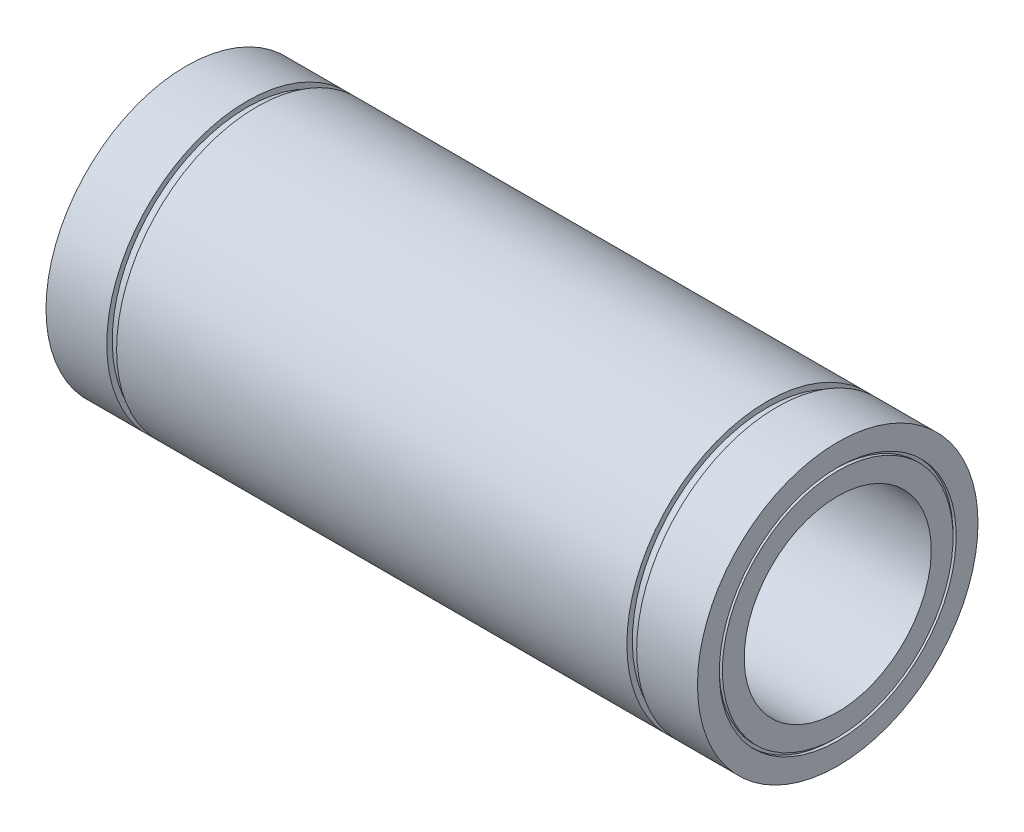
ISO-10303-21;
HEADER;
FILE_DESCRIPTION(('STEP AP214'),'2;1');
FILE_NAME('part.step','',(''),(''),'','','');
FILE_SCHEMA(('AUTOMOTIVE_DESIGN { 1 0 10303 214 1 1 1 1 }'));
ENDSEC;
DATA;
#1=APPLICATION_CONTEXT('core data for automotive mechanical design processes');
#2=APPLICATION_PROTOCOL_DEFINITION('international standard','automotive_design',2000,#1);
#3=PRODUCT_CONTEXT('',#1,'mechanical');
#4=PRODUCT('Part','Part','',(#3));
#5=PRODUCT_RELATED_PRODUCT_CATEGORY('part','',(#4));
#6=PRODUCT_DEFINITION_FORMATION('','',#4);
#7=PRODUCT_DEFINITION_CONTEXT('part definition',#1,'design');
#8=PRODUCT_DEFINITION('design','',#6,#7);
#9=PRODUCT_DEFINITION_SHAPE('','',#8);
#10=(LENGTH_UNIT() NAMED_UNIT(*) SI_UNIT(.MILLI.,.METRE.));
#11=(NAMED_UNIT(*) PLANE_ANGLE_UNIT() SI_UNIT($,.RADIAN.));
#12=(NAMED_UNIT(*) SI_UNIT($,.STERADIAN.) SOLID_ANGLE_UNIT());
#13=UNCERTAINTY_MEASURE_WITH_UNIT(LENGTH_MEASURE(1.E-05),#10,'distance_accuracy_value','');
#14=(GEOMETRIC_REPRESENTATION_CONTEXT(3) GLOBAL_UNCERTAINTY_ASSIGNED_CONTEXT((#13)) GLOBAL_UNIT_ASSIGNED_CONTEXT((#10,
#11,#12)) REPRESENTATION_CONTEXT('',''));
#15=CARTESIAN_POINT('',(0.,0.,0.));
#16=DIRECTION('',(0.,0.,1.));
#17=DIRECTION('',(1.,0.,0.));
#18=AXIS2_PLACEMENT_3D('',#15,#16,#17);
#19=CARTESIAN_POINT('',(-104.5,38.,0.));
#20=DIRECTION('',(-1.,0.,0.));
#21=DIRECTION('',(0.,-1.,0.));
#22=AXIS2_PLACEMENT_3D('',#19,#20,#21);
#23=PLANE('',#22);
#24=CARTESIAN_POINT('',(-104.5,0.,0.));
#25=DIRECTION('',(1.,0.,0.));
#26=DIRECTION('',(0.,1.,0.));
#27=AXIS2_PLACEMENT_3D('',#24,#25,#26);
#28=CIRCLE('',#27,38.);
#29=CARTESIAN_POINT('',(-104.5,38.,0.));
#30=VERTEX_POINT('',#29);
#31=EDGE_CURVE('E123',#30,#30,#28,.T.);
#32=ORIENTED_EDGE('',*,*,#31,.T.);
#33=EDGE_LOOP('',(#32));
#34=FACE_BOUND('',#33,.T.);
#35=CARTESIAN_POINT('',(-104.5,0.,0.));
#36=DIRECTION('',(1.,0.,0.));
#37=DIRECTION('',(0.,1.,0.));
#38=AXIS2_PLACEMENT_3D('',#35,#36,#37);
#39=CIRCLE('',#38,45.);
#40=CARTESIAN_POINT('',(-104.5,45.,0.));
#41=VERTEX_POINT('',#40);
#42=EDGE_CURVE('E10',#41,#41,#39,.T.);
#43=ORIENTED_EDGE('',*,*,#42,.F.);
#44=EDGE_LOOP('',(#43));
#45=FACE_BOUND('',#44,.T.);
#46=ADVANCED_FACE('F40',(#34,#45),#23,.T.);
#47=CARTESIAN_POINT('',(0.,0.,0.));
#48=DIRECTION('',(1.,0.,0.));
#49=DIRECTION('',(0.,1.,0.));
#50=AXIS2_PLACEMENT_3D('',#47,#48,#49);
#51=CYLINDRICAL_SURFACE('',#50,45.);
#52=ORIENTED_EDGE('',*,*,#42,.T.);
#53=EDGE_LOOP('',(#52));
#54=FACE_BOUND('',#53,.T.);
#55=CARTESIAN_POINT('',(-85.,0.,0.));
#56=DIRECTION('',(1.,0.,0.));
#57=DIRECTION('',(0.,1.,0.));
#58=AXIS2_PLACEMENT_3D('',#55,#56,#57);
#59=CIRCLE('',#58,45.);
#60=CARTESIAN_POINT('',(-85.,45.,0.));
#61=VERTEX_POINT('',#60);
#62=EDGE_CURVE('E47',#61,#61,#59,.T.);
#63=ORIENTED_EDGE('',*,*,#62,.F.);
#64=EDGE_LOOP('',(#63));
#65=FACE_BOUND('',#64,.T.);
#66=ADVANCED_FACE('F142',(#54,#65),#51,.T.);
#67=CARTESIAN_POINT('',(-85.,45.,0.));
#68=DIRECTION('',(1.,0.,0.));
#69=DIRECTION('',(0.,1.,0.));
#70=AXIS2_PLACEMENT_3D('',#67,#68,#69);
#71=PLANE('',#70);
#72=ORIENTED_EDGE('',*,*,#62,.T.);
#73=EDGE_LOOP('',(#72));
#74=FACE_BOUND('',#73,.T.);
#75=CARTESIAN_POINT('',(-85.,0.,0.));
#76=DIRECTION('',(1.,0.,0.));
#77=DIRECTION('',(0.,1.,0.));
#78=AXIS2_PLACEMENT_3D('',#75,#76,#77);
#79=CIRCLE('',#78,43.25);
#80=CARTESIAN_POINT('',(-85.,43.25,0.));
#81=VERTEX_POINT('',#80);
#82=EDGE_CURVE('E54',#81,#81,#79,.T.);
#83=ORIENTED_EDGE('',*,*,#82,.F.);
#84=EDGE_LOOP('',(#83));
#85=FACE_BOUND('',#84,.T.);
#86=ADVANCED_FACE('F146',(#74,#85),#71,.T.);
#87=CARTESIAN_POINT('',(0.,0.,0.));
#88=DIRECTION('',(1.,0.,0.));
#89=DIRECTION('',(0.,1.,0.));
#90=AXIS2_PLACEMENT_3D('',#87,#88,#89);
#91=CYLINDRICAL_SURFACE('',#90,43.25);
#92=ORIENTED_EDGE('',*,*,#82,.T.);
#93=EDGE_LOOP('',(#92));
#94=FACE_BOUND('',#93,.T.);
#95=CARTESIAN_POINT('',(-81.85,0.,0.));
#96=DIRECTION('',(1.,0.,0.));
#97=DIRECTION('',(0.,1.,0.));
#98=AXIS2_PLACEMENT_3D('',#95,#96,#97);
#99=CIRCLE('',#98,43.25);
#100=CARTESIAN_POINT('',(-81.85,43.25,0.));
#101=VERTEX_POINT('',#100);
#102=EDGE_CURVE('E61',#101,#101,#99,.T.);
#103=ORIENTED_EDGE('',*,*,#102,.F.);
#104=EDGE_LOOP('',(#103));
#105=FACE_BOUND('',#104,.T.);
#106=ADVANCED_FACE('F150',(#94,#105),#91,.T.);
#107=CARTESIAN_POINT('',(-81.85,43.25,0.));
#108=DIRECTION('',(-1.,0.,0.));
#109=DIRECTION('',(0.,-1.,0.));
#110=AXIS2_PLACEMENT_3D('',#107,#108,#109);
#111=PLANE('',#110);
#112=ORIENTED_EDGE('',*,*,#102,.T.);
#113=EDGE_LOOP('',(#112));
#114=FACE_BOUND('',#113,.T.);
#115=CARTESIAN_POINT('',(-81.85,0.,0.));
#116=DIRECTION('',(1.,0.,0.));
#117=DIRECTION('',(0.,1.,0.));
#118=AXIS2_PLACEMENT_3D('',#115,#116,#117);
#119=CIRCLE('',#118,45.);
#120=CARTESIAN_POINT('',(-81.85,45.,0.));
#121=VERTEX_POINT('',#120);
#122=EDGE_CURVE('E67',#121,#121,#119,.T.);
#123=ORIENTED_EDGE('',*,*,#122,.F.);
#124=EDGE_LOOP('',(#123));
#125=FACE_BOUND('',#124,.T.);
#126=ADVANCED_FACE('F156',(#114,#125),#111,.T.);
#127=CARTESIAN_POINT('',(0.,0.,0.));
#128=DIRECTION('',(1.,0.,0.));
#129=DIRECTION('',(0.,1.,0.));
#130=AXIS2_PLACEMENT_3D('',#127,#128,#129);
#131=CYLINDRICAL_SURFACE('',#130,45.);
#132=ORIENTED_EDGE('',*,*,#122,.T.);
#133=EDGE_LOOP('',(#132));
#134=FACE_BOUND('',#133,.T.);
#135=CARTESIAN_POINT('',(81.85,0.,0.));
#136=DIRECTION('',(1.,0.,0.));
#137=DIRECTION('',(0.,1.,0.));
#138=AXIS2_PLACEMENT_3D('',#135,#136,#137);
#139=CIRCLE('',#138,45.);
#140=CARTESIAN_POINT('',(81.85,45.,0.));
#141=VERTEX_POINT('',#140);
#142=EDGE_CURVE('E71',#141,#141,#139,.T.);
#143=ORIENTED_EDGE('',*,*,#142,.F.);
#144=EDGE_LOOP('',(#143));
#145=FACE_BOUND('',#144,.T.);
#146=ADVANCED_FACE('F160',(#134,#145),#131,.T.);
#147=CARTESIAN_POINT('',(81.85,45.,0.));
#148=DIRECTION('',(1.,0.,0.));
#149=DIRECTION('',(0.,1.,0.));
#150=AXIS2_PLACEMENT_3D('',#147,#148,#149);
#151=PLANE('',#150);
#152=ORIENTED_EDGE('',*,*,#142,.T.);
#153=EDGE_LOOP('',(#152));
#154=FACE_BOUND('',#153,.T.);
#155=CARTESIAN_POINT('',(81.85,0.,0.));
#156=DIRECTION('',(1.,0.,0.));
#157=DIRECTION('',(0.,1.,0.));
#158=AXIS2_PLACEMENT_3D('',#155,#156,#157);
#159=CIRCLE('',#158,43.25);
#160=CARTESIAN_POINT('',(81.85,43.25,0.));
#161=VERTEX_POINT('',#160);
#162=EDGE_CURVE('E75',#161,#161,#159,.T.);
#163=ORIENTED_EDGE('',*,*,#162,.F.);
#164=EDGE_LOOP('',(#163));
#165=FACE_BOUND('',#164,.T.);
#166=ADVANCED_FACE('F164',(#154,#165),#151,.T.);
#167=CARTESIAN_POINT('',(0.,0.,0.));
#168=DIRECTION('',(1.,0.,0.));
#169=DIRECTION('',(0.,1.,0.));
#170=AXIS2_PLACEMENT_3D('',#167,#168,#169);
#171=CYLINDRICAL_SURFACE('',#170,43.25);
#172=ORIENTED_EDGE('',*,*,#162,.T.);
#173=EDGE_LOOP('',(#172));
#174=FACE_BOUND('',#173,.T.);
#175=CARTESIAN_POINT('',(85.,0.,0.));
#176=DIRECTION('',(1.,0.,0.));
#177=DIRECTION('',(0.,1.,0.));
#178=AXIS2_PLACEMENT_3D('',#175,#176,#177);
#179=CIRCLE('',#178,43.25);
#180=CARTESIAN_POINT('',(85.,43.25,0.));
#181=VERTEX_POINT('',#180);
#182=EDGE_CURVE('E78',#181,#181,#179,.T.);
#183=ORIENTED_EDGE('',*,*,#182,.F.);
#184=EDGE_LOOP('',(#183));
#185=FACE_BOUND('',#184,.T.);
#186=ADVANCED_FACE('F168',(#174,#185),#171,.T.);
#187=CARTESIAN_POINT('',(85.,43.25,0.));
#188=DIRECTION('',(-1.,0.,0.));
#189=DIRECTION('',(0.,-1.,0.));
#190=AXIS2_PLACEMENT_3D('',#187,#188,#189);
#191=PLANE('',#190);
#192=ORIENTED_EDGE('',*,*,#182,.T.);
#193=EDGE_LOOP('',(#192));
#194=FACE_BOUND('',#193,.T.);
#195=CARTESIAN_POINT('',(85.,0.,0.));
#196=DIRECTION('',(1.,0.,0.));
#197=DIRECTION('',(0.,1.,0.));
#198=AXIS2_PLACEMENT_3D('',#195,#196,#197);
#199=CIRCLE('',#198,45.);
#200=CARTESIAN_POINT('',(85.,45.,0.));
#201=VERTEX_POINT('',#200);
#202=EDGE_CURVE('E81',#201,#201,#199,.T.);
#203=ORIENTED_EDGE('',*,*,#202,.F.);
#204=EDGE_LOOP('',(#203));
#205=FACE_BOUND('',#204,.T.);
#206=ADVANCED_FACE('F172',(#194,#205),#191,.T.);
#207=CARTESIAN_POINT('',(0.,0.,0.));
#208=DIRECTION('',(1.,0.,0.));
#209=DIRECTION('',(0.,1.,0.));
#210=AXIS2_PLACEMENT_3D('',#207,#208,#209);
#211=CYLINDRICAL_SURFACE('',#210,44.9999999999999);
#212=ORIENTED_EDGE('',*,*,#202,.T.);
#213=EDGE_LOOP('',(#212));
#214=FACE_BOUND('',#213,.T.);
#215=CARTESIAN_POINT('',(104.5,0.,0.));
#216=DIRECTION('',(1.,0.,0.));
#217=DIRECTION('',(0.,1.,0.));
#218=AXIS2_PLACEMENT_3D('',#215,#216,#217);
#219=CIRCLE('',#218,44.9999999999999);
#220=CARTESIAN_POINT('',(104.5,44.9999999999999,0.));
#221=VERTEX_POINT('',#220);
#222=EDGE_CURVE('E84',#221,#221,#219,.T.);
#223=ORIENTED_EDGE('',*,*,#222,.F.);
#224=EDGE_LOOP('',(#223));
#225=FACE_BOUND('',#224,.T.);
#226=ADVANCED_FACE('F176',(#214,#225),#211,.T.);
#227=CARTESIAN_POINT('',(104.5,44.9999999999999,0.));
#228=DIRECTION('',(1.,0.,0.));
#229=DIRECTION('',(0.,1.,0.));
#230=AXIS2_PLACEMENT_3D('',#227,#228,#229);
#231=PLANE('',#230);
#232=ORIENTED_EDGE('',*,*,#222,.T.);
#233=EDGE_LOOP('',(#232));
#234=FACE_BOUND('',#233,.T.);
#235=CARTESIAN_POINT('',(104.5,0.,0.));
#236=DIRECTION('',(1.,0.,0.));
#237=DIRECTION('',(0.,1.,0.));
#238=AXIS2_PLACEMENT_3D('',#235,#236,#237);
#239=CIRCLE('',#238,37.9999999999999);
#240=CARTESIAN_POINT('',(104.5,37.9999999999999,0.));
#241=VERTEX_POINT('',#240);
#242=EDGE_CURVE('E87',#241,#241,#239,.T.);
#243=ORIENTED_EDGE('',*,*,#242,.F.);
#244=EDGE_LOOP('',(#243));
#245=FACE_BOUND('',#244,.T.);
#246=ADVANCED_FACE('F180',(#234,#245),#231,.T.);
#247=CARTESIAN_POINT('',(0.,0.,0.));
#248=DIRECTION('',(1.,0.,0.));
#249=DIRECTION('',(0.,1.,0.));
#250=AXIS2_PLACEMENT_3D('',#247,#248,#249);
#251=CYLINDRICAL_SURFACE('',#250,37.9999999999999);
#252=ORIENTED_EDGE('',*,*,#242,.T.);
#253=EDGE_LOOP('',(#252));
#254=FACE_BOUND('',#253,.T.);
#255=CARTESIAN_POINT('',(103.5,0.,0.));
#256=DIRECTION('',(1.,0.,0.));
#257=DIRECTION('',(0.,1.,0.));
#258=AXIS2_PLACEMENT_3D('',#255,#256,#257);
#259=CIRCLE('',#258,37.9999999999999);
#260=CARTESIAN_POINT('',(103.5,37.9999999999999,0.));
#261=VERTEX_POINT('',#260);
#262=EDGE_CURVE('E91',#261,#261,#259,.T.);
#263=ORIENTED_EDGE('',*,*,#262,.F.);
#264=EDGE_LOOP('',(#263));
#265=FACE_BOUND('',#264,.T.);
#266=ADVANCED_FACE('F184',(#254,#265),#251,.F.);
#267=CARTESIAN_POINT('',(103.5,37.9999999999999,0.));
#268=DIRECTION('',(1.,0.,0.));
#269=DIRECTION('',(0.,1.,0.));
#270=AXIS2_PLACEMENT_3D('',#267,#268,#269);
#271=PLANE('',#270);
#272=ORIENTED_EDGE('',*,*,#262,.T.);
#273=EDGE_LOOP('',(#272));
#274=FACE_BOUND('',#273,.T.);
#275=CARTESIAN_POINT('',(103.5,0.,0.));
#276=DIRECTION('',(1.,0.,0.));
#277=DIRECTION('',(0.,1.,0.));
#278=AXIS2_PLACEMENT_3D('',#275,#276,#277);
#279=CIRCLE('',#278,36.9999999999999);
#280=CARTESIAN_POINT('',(103.5,36.9999999999999,0.));
#281=VERTEX_POINT('',#280);
#282=EDGE_CURVE('E95',#281,#281,#279,.T.);
#283=ORIENTED_EDGE('',*,*,#282,.F.);
#284=EDGE_LOOP('',(#283));
#285=FACE_BOUND('',#284,.T.);
#286=ADVANCED_FACE('F188',(#274,#285),#271,.T.);
#287=CARTESIAN_POINT('',(0.,0.,0.));
#288=DIRECTION('',(1.,0.,0.));
#289=DIRECTION('',(0.,1.,0.));
#290=AXIS2_PLACEMENT_3D('',#287,#288,#289);
#291=CYLINDRICAL_SURFACE('',#290,36.9999999999999);
#292=ORIENTED_EDGE('',*,*,#282,.T.);
#293=EDGE_LOOP('',(#292));
#294=FACE_BOUND('',#293,.T.);
#295=CARTESIAN_POINT('',(104.5,0.,0.));
#296=DIRECTION('',(1.,0.,0.));
#297=DIRECTION('',(0.,1.,0.));
#298=AXIS2_PLACEMENT_3D('',#295,#296,#297);
#299=CIRCLE('',#298,36.9999999999999);
#300=CARTESIAN_POINT('',(104.5,36.9999999999999,0.));
#301=VERTEX_POINT('',#300);
#302=EDGE_CURVE('E99',#301,#301,#299,.T.);
#303=ORIENTED_EDGE('',*,*,#302,.F.);
#304=EDGE_LOOP('',(#303));
#305=FACE_BOUND('',#304,.T.);
#306=ADVANCED_FACE('F192',(#294,#305),#291,.T.);
#307=CARTESIAN_POINT('',(104.5,36.9999999999999,0.));
#308=DIRECTION('',(1.,0.,0.));
#309=DIRECTION('',(0.,1.,0.));
#310=AXIS2_PLACEMENT_3D('',#307,#308,#309);
#311=PLANE('',#310);
#312=ORIENTED_EDGE('',*,*,#302,.T.);
#313=EDGE_LOOP('',(#312));
#314=FACE_BOUND('',#313,.T.);
#315=CARTESIAN_POINT('',(104.5,0.,0.));
#316=DIRECTION('',(1.,0.,0.));
#317=DIRECTION('',(0.,1.,0.));
#318=AXIS2_PLACEMENT_3D('',#315,#316,#317);
#319=CIRCLE('',#318,30.);
#320=CARTESIAN_POINT('',(104.5,30.,0.));
#321=VERTEX_POINT('',#320);
#322=EDGE_CURVE('E103',#321,#321,#319,.T.);
#323=ORIENTED_EDGE('',*,*,#322,.F.);
#324=EDGE_LOOP('',(#323));
#325=FACE_BOUND('',#324,.T.);
#326=ADVANCED_FACE('F196',(#314,#325),#311,.T.);
#327=CARTESIAN_POINT('',(0.,0.,0.));
#328=DIRECTION('',(1.,0.,0.));
#329=DIRECTION('',(0.,1.,0.));
#330=AXIS2_PLACEMENT_3D('',#327,#328,#329);
#331=CYLINDRICAL_SURFACE('',#330,30.);
#332=ORIENTED_EDGE('',*,*,#322,.T.);
#333=EDGE_LOOP('',(#332));
#334=FACE_BOUND('',#333,.T.);
#335=CARTESIAN_POINT('',(-104.5,0.,0.));
#336=DIRECTION('',(1.,0.,0.));
#337=DIRECTION('',(0.,1.,0.));
#338=AXIS2_PLACEMENT_3D('',#335,#336,#337);
#339=CIRCLE('',#338,30.);
#340=CARTESIAN_POINT('',(-104.5,30.,0.));
#341=VERTEX_POINT('',#340);
#342=EDGE_CURVE('E107',#341,#341,#339,.T.);
#343=ORIENTED_EDGE('',*,*,#342,.F.);
#344=EDGE_LOOP('',(#343));
#345=FACE_BOUND('',#344,.T.);
#346=ADVANCED_FACE('F200',(#334,#345),#331,.F.);
#347=CARTESIAN_POINT('',(-104.5,30.,0.));
#348=DIRECTION('',(-1.,0.,0.));
#349=DIRECTION('',(0.,-1.,0.));
#350=AXIS2_PLACEMENT_3D('',#347,#348,#349);
#351=PLANE('',#350);
#352=ORIENTED_EDGE('',*,*,#342,.T.);
#353=EDGE_LOOP('',(#352));
#354=FACE_BOUND('',#353,.T.);
#355=CARTESIAN_POINT('',(-104.5,0.,0.));
#356=DIRECTION('',(1.,0.,0.));
#357=DIRECTION('',(0.,1.,0.));
#358=AXIS2_PLACEMENT_3D('',#355,#356,#357);
#359=CIRCLE('',#358,37.);
#360=CARTESIAN_POINT('',(-104.5,37.,0.));
#361=VERTEX_POINT('',#360);
#362=EDGE_CURVE('E111',#361,#361,#359,.T.);
#363=ORIENTED_EDGE('',*,*,#362,.F.);
#364=EDGE_LOOP('',(#363));
#365=FACE_BOUND('',#364,.T.);
#366=ADVANCED_FACE('F204',(#354,#365),#351,.T.);
#367=CARTESIAN_POINT('',(0.,0.,0.));
#368=DIRECTION('',(1.,0.,0.));
#369=DIRECTION('',(0.,1.,0.));
#370=AXIS2_PLACEMENT_3D('',#367,#368,#369);
#371=CYLINDRICAL_SURFACE('',#370,37.);
#372=ORIENTED_EDGE('',*,*,#362,.T.);
#373=EDGE_LOOP('',(#372));
#374=FACE_BOUND('',#373,.T.);
#375=CARTESIAN_POINT('',(-103.5,0.,0.));
#376=DIRECTION('',(1.,0.,0.));
#377=DIRECTION('',(0.,1.,0.));
#378=AXIS2_PLACEMENT_3D('',#375,#376,#377);
#379=CIRCLE('',#378,37.);
#380=CARTESIAN_POINT('',(-103.5,37.,0.));
#381=VERTEX_POINT('',#380);
#382=EDGE_CURVE('E115',#381,#381,#379,.T.);
#383=ORIENTED_EDGE('',*,*,#382,.F.);
#384=EDGE_LOOP('',(#383));
#385=FACE_BOUND('',#384,.T.);
#386=ADVANCED_FACE('F138',(#374,#385),#371,.T.);
#387=CARTESIAN_POINT('',(-103.5,38.,0.));
#388=DIRECTION('',(-1.,0.,0.));
#389=DIRECTION('',(0.,-1.,0.));
#390=AXIS2_PLACEMENT_3D('',#387,#388,#389);
#391=PLANE('',#390);
#392=ORIENTED_EDGE('',*,*,#382,.T.);
#393=EDGE_LOOP('',(#392));
#394=FACE_BOUND('',#393,.T.);
#395=CARTESIAN_POINT('',(-103.5,0.,0.));
#396=DIRECTION('',(1.,0.,0.));
#397=DIRECTION('',(0.,1.,0.));
#398=AXIS2_PLACEMENT_3D('',#395,#396,#397);
#399=CIRCLE('',#398,38.);
#400=CARTESIAN_POINT('',(-103.5,38.,0.));
#401=VERTEX_POINT('',#400);
#402=EDGE_CURVE('E119',#401,#401,#399,.T.);
#403=ORIENTED_EDGE('',*,*,#402,.F.);
#404=EDGE_LOOP('',(#403));
#405=FACE_BOUND('',#404,.T.);
#406=ADVANCED_FACE('F132',(#394,#405),#391,.T.);
#407=CARTESIAN_POINT('',(0.,0.,0.));
#408=DIRECTION('',(1.,0.,0.));
#409=DIRECTION('',(0.,1.,0.));
#410=AXIS2_PLACEMENT_3D('',#407,#408,#409);
#411=CYLINDRICAL_SURFACE('',#410,38.);
#412=ORIENTED_EDGE('',*,*,#402,.T.);
#413=EDGE_LOOP('',(#412));
#414=FACE_BOUND('',#413,.T.);
#415=ORIENTED_EDGE('',*,*,#31,.F.);
#416=EDGE_LOOP('',(#415));
#417=FACE_BOUND('',#416,.T.);
#418=ADVANCED_FACE('F130',(#414,#417),#411,.F.);
#419=CLOSED_SHELL('',(#46,#66,#86,#106,#126,#146,#166,#186,#206,#226,#246,#266,#286,#306,#326,
#346,#366,#386,#406,#418));
#420=MANIFOLD_SOLID_BREP('B2',#419);
#421=ADVANCED_BREP_SHAPE_REPRESENTATION('',(#18,#420),#14);
#422=SHAPE_DEFINITION_REPRESENTATION(#9,#421);
ENDSEC;
END-ISO-10303-21;
